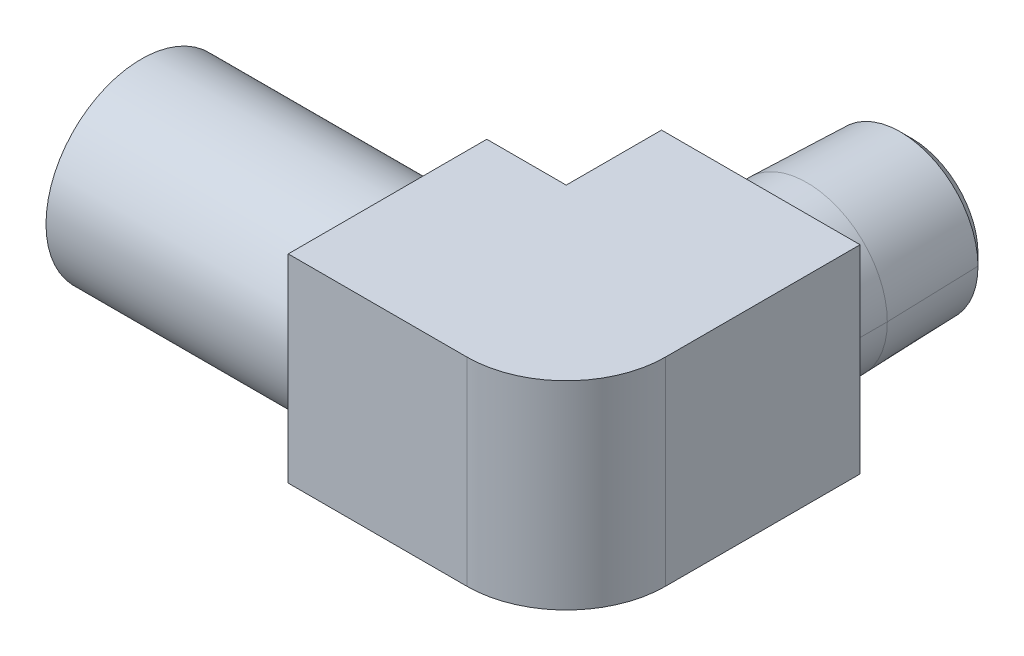
ISO-10303-21;
HEADER;
FILE_DESCRIPTION(('STEP AP214'),'2;1');
FILE_NAME('part.step','',(''),(''),'','','');
FILE_SCHEMA(('AUTOMOTIVE_DESIGN { 1 0 10303 214 1 1 1 1 }'));
ENDSEC;
DATA;
#1=APPLICATION_CONTEXT('core data for automotive mechanical design processes');
#2=APPLICATION_PROTOCOL_DEFINITION('international standard','automotive_design',2000,#1);
#3=PRODUCT_CONTEXT('',#1,'mechanical');
#4=PRODUCT('Part','Part','',(#3));
#5=PRODUCT_RELATED_PRODUCT_CATEGORY('part','',(#4));
#6=PRODUCT_DEFINITION_FORMATION('','',#4);
#7=PRODUCT_DEFINITION_CONTEXT('part definition',#1,'design');
#8=PRODUCT_DEFINITION('design','',#6,#7);
#9=PRODUCT_DEFINITION_SHAPE('','',#8);
#10=(LENGTH_UNIT() NAMED_UNIT(*) SI_UNIT(.MILLI.,.METRE.));
#11=(NAMED_UNIT(*) PLANE_ANGLE_UNIT() SI_UNIT($,.RADIAN.));
#12=(NAMED_UNIT(*) SI_UNIT($,.STERADIAN.) SOLID_ANGLE_UNIT());
#13=UNCERTAINTY_MEASURE_WITH_UNIT(LENGTH_MEASURE(1.E-05),#10,'distance_accuracy_value','');
#14=(GEOMETRIC_REPRESENTATION_CONTEXT(3) GLOBAL_UNCERTAINTY_ASSIGNED_CONTEXT((#13)) GLOBAL_UNIT_ASSIGNED_CONTEXT((#10,
#11,#12)) REPRESENTATION_CONTEXT('',''));
#15=CARTESIAN_POINT('',(0.,0.,0.));
#16=DIRECTION('',(0.,0.,1.));
#17=DIRECTION('',(1.,0.,0.));
#18=AXIS2_PLACEMENT_3D('',#15,#16,#17);
#19=CARTESIAN_POINT('',(27.178,0.,-18.74647));
#20=DIRECTION('',(0.,0.,1.));
#21=DIRECTION('',(-1.,0.,0.));
#22=AXIS2_PLACEMENT_3D('',#19,#20,#21);
#23=CONICAL_SURFACE('',#22,5.03914980109326,0.0311250383214112);
#24=DIRECTION('',(-0.0311200130745938,0.,0.999515655098127));
#25=VECTOR('',#24,1.);
#26=CARTESIAN_POINT('',(22.1388501989067,0.,-18.74647));
#27=LINE('',#26,#25);
#28=CARTESIAN_POINT('',(22.2208896002843,0.,-21.3814196002843));
#29=VERTEX_POINT('',#28);
#30=CARTESIAN_POINT('',(22.0345,0.,-15.39494));
#31=VERTEX_POINT('',#30);
#32=EDGE_CURVE('E49',#29,#31,#27,.T.);
#33=ORIENTED_EDGE('',*,*,#32,.F.);
#34=CARTESIAN_POINT('',(27.178,0.,-21.3814196002843));
#35=DIRECTION('',(0.,0.,1.));
#36=DIRECTION('',(-1.,0.,0.));
#37=AXIS2_PLACEMENT_3D('',#34,#35,#36);
#38=CIRCLE('',#37,4.9571103997157);
#39=CARTESIAN_POINT('',(32.1351103997157,0.,-21.3814196002843));
#40=VERTEX_POINT('',#39);
#41=EDGE_CURVE('E365',#29,#40,#38,.T.);
#42=ORIENTED_EDGE('',*,*,#41,.T.);
#43=DIRECTION('',(-0.0311200130745935,0.,-0.999515655098127));
#44=VECTOR('',#43,1.);
#45=CARTESIAN_POINT('',(32.2171498010933,0.,-18.74647));
#46=LINE('',#45,#44);
#47=CARTESIAN_POINT('',(32.3215,0.,-15.39494));
#48=VERTEX_POINT('',#47);
#49=EDGE_CURVE('E11',#48,#40,#46,.T.);
#50=ORIENTED_EDGE('',*,*,#49,.F.);
#51=CARTESIAN_POINT('',(27.178,0.,-15.39494));
#52=DIRECTION('',(0.,0.,1.));
#53=DIRECTION('',(-1.,0.,0.));
#54=AXIS2_PLACEMENT_3D('',#51,#52,#53);
#55=CIRCLE('',#54,5.1435);
#56=EDGE_CURVE('E339',#31,#48,#55,.T.);
#57=ORIENTED_EDGE('',*,*,#56,.F.);
#58=EDGE_LOOP('',(#33,#42,#50,#57));
#59=FACE_BOUND('',#58,.T.);
#60=ADVANCED_FACE('F46',(#59),#23,.T.);
#61=CARTESIAN_POINT('',(27.178,0.,-18.74647));
#62=DIRECTION('',(0.,0.,1.));
#63=DIRECTION('',(-1.,0.,0.));
#64=AXIS2_PLACEMENT_3D('',#61,#62,#63);
#65=CONICAL_SURFACE('',#64,5.03914980109326,0.0311250383214112);
#66=ORIENTED_EDGE('',*,*,#32,.T.);
#67=CARTESIAN_POINT('',(27.178,0.,-15.39494));
#68=DIRECTION('',(0.,0.,1.));
#69=DIRECTION('',(-1.,0.,0.));
#70=AXIS2_PLACEMENT_3D('',#67,#68,#69);
#71=CIRCLE('',#70,5.1435);
#72=EDGE_CURVE('E197',#48,#31,#71,.T.);
#73=ORIENTED_EDGE('',*,*,#72,.F.);
#74=ORIENTED_EDGE('',*,*,#49,.T.);
#75=CARTESIAN_POINT('',(27.178,0.,-21.3814196002843));
#76=DIRECTION('',(0.,0.,1.));
#77=DIRECTION('',(-1.,0.,0.));
#78=AXIS2_PLACEMENT_3D('',#75,#76,#77);
#79=CIRCLE('',#78,4.9571103997157);
#80=EDGE_CURVE('E364',#40,#29,#79,.T.);
#81=ORIENTED_EDGE('',*,*,#80,.T.);
#82=EDGE_LOOP('',(#66,#73,#74,#81));
#83=FACE_BOUND('',#82,.T.);
#84=ADVANCED_FACE('F576',(#83),#65,.T.);
#85=CARTESIAN_POINT('',(27.178,0.,-21.646515));
#86=DIRECTION('',(0.,0.,1.));
#87=DIRECTION('',(-1.,0.,0.));
#88=AXIS2_PLACEMENT_3D('',#85,#86,#87);
#89=CONICAL_SURFACE('',#88,4.692015,0.785398163397448);
#90=DIRECTION('',(0.707106781186548,0.,-0.707106781186547));
#91=VECTOR('',#90,1.);
#92=CARTESIAN_POINT('',(22.485985,0.,-21.646515));
#93=LINE('',#92,#91);
#94=CARTESIAN_POINT('',(22.93747,0.,-22.098));
#95=VERTEX_POINT('',#94);
#96=EDGE_CURVE('E361',#29,#95,#93,.T.);
#97=ORIENTED_EDGE('',*,*,#96,.T.);
#98=CARTESIAN_POINT('',(27.178,0.,-22.098));
#99=DIRECTION('',(0.,0.,-1.));
#100=DIRECTION('',(-1.,0.,0.));
#101=AXIS2_PLACEMENT_3D('',#98,#99,#100);
#102=CIRCLE('',#101,4.24053);
#103=CARTESIAN_POINT('',(31.41853,0.,-22.098));
#104=VERTEX_POINT('',#103);
#105=EDGE_CURVE('E241',#104,#95,#102,.T.);
#106=ORIENTED_EDGE('',*,*,#105,.F.);
#107=DIRECTION('',(0.707106781186548,0.,0.707106781186547));
#108=VECTOR('',#107,1.);
#109=CARTESIAN_POINT('',(31.870015,0.,-21.646515));
#110=LINE('',#109,#108);
#111=EDGE_CURVE('E202',#104,#40,#110,.T.);
#112=ORIENTED_EDGE('',*,*,#111,.T.);
#113=ORIENTED_EDGE('',*,*,#41,.F.);
#114=EDGE_LOOP('',(#97,#106,#112,#113));
#115=FACE_BOUND('',#114,.T.);
#116=ADVANCED_FACE('F441',(#115),#89,.T.);
#117=CARTESIAN_POINT('',(27.178,0.,-13.92047));
#118=DIRECTION('',(0.,0.,1.));
#119=DIRECTION('',(-1.,0.,0.));
#120=AXIS2_PLACEMENT_3D('',#117,#118,#119);
#121=CYLINDRICAL_SURFACE('',#120,5.1435);
#122=DIRECTION('',(0.,0.,1.));
#123=VECTOR('',#122,1.);
#124=CARTESIAN_POINT('',(22.0345,0.,-13.92047));
#125=LINE('',#124,#123);
#126=CARTESIAN_POINT('',(22.0345,0.,-12.446));
#127=VERTEX_POINT('',#126);
#128=EDGE_CURVE('E191',#31,#127,#125,.T.);
#129=ORIENTED_EDGE('',*,*,#128,.F.);
#130=ORIENTED_EDGE('',*,*,#56,.T.);
#131=DIRECTION('',(0.,0.,-1.));
#132=VECTOR('',#131,1.);
#133=CARTESIAN_POINT('',(32.3215,0.,-13.92047));
#134=LINE('',#133,#132);
#135=CARTESIAN_POINT('',(32.3215,0.,-12.446));
#136=VERTEX_POINT('',#135);
#137=EDGE_CURVE('E201',#136,#48,#134,.T.);
#138=ORIENTED_EDGE('',*,*,#137,.F.);
#139=CARTESIAN_POINT('',(27.178,0.,-12.446));
#140=DIRECTION('',(0.,0.,1.));
#141=DIRECTION('',(-1.,0.,0.));
#142=AXIS2_PLACEMENT_3D('',#139,#140,#141);
#143=CIRCLE('',#142,5.1435);
#144=EDGE_CURVE('E207',#127,#136,#143,.T.);
#145=ORIENTED_EDGE('',*,*,#144,.F.);
#146=EDGE_LOOP('',(#129,#130,#138,#145));
#147=FACE_BOUND('',#146,.T.);
#148=ADVANCED_FACE('F211',(#147),#121,.T.);
#149=CARTESIAN_POINT('',(27.178,0.,-13.92047));
#150=DIRECTION('',(0.,0.,1.));
#151=DIRECTION('',(-1.,0.,0.));
#152=AXIS2_PLACEMENT_3D('',#149,#150,#151);
#153=CYLINDRICAL_SURFACE('',#152,5.1435);
#154=ORIENTED_EDGE('',*,*,#128,.T.);
#155=CARTESIAN_POINT('',(27.178,0.,-12.446));
#156=DIRECTION('',(0.,0.,1.));
#157=DIRECTION('',(-1.,0.,0.));
#158=AXIS2_PLACEMENT_3D('',#155,#156,#157);
#159=CIRCLE('',#158,5.1435);
#160=EDGE_CURVE('E195',#136,#127,#159,.T.);
#161=ORIENTED_EDGE('',*,*,#160,.F.);
#162=ORIENTED_EDGE('',*,*,#137,.T.);
#163=ORIENTED_EDGE('',*,*,#72,.T.);
#164=EDGE_LOOP('',(#154,#161,#162,#163));
#165=FACE_BOUND('',#164,.T.);
#166=ADVANCED_FACE('F193',(#165),#153,.T.);
#167=CARTESIAN_POINT('',(27.178,0.,-21.646515));
#168=DIRECTION('',(0.,0.,1.));
#169=DIRECTION('',(-1.,0.,0.));
#170=AXIS2_PLACEMENT_3D('',#167,#168,#169);
#171=CONICAL_SURFACE('',#170,4.692015,0.785398163397448);
#172=ORIENTED_EDGE('',*,*,#96,.F.);
#173=ORIENTED_EDGE('',*,*,#80,.F.);
#174=ORIENTED_EDGE('',*,*,#111,.F.);
#175=CARTESIAN_POINT('',(27.178,0.,-22.098));
#176=DIRECTION('',(0.,0.,-1.));
#177=DIRECTION('',(-1.,0.,0.));
#178=AXIS2_PLACEMENT_3D('',#175,#176,#177);
#179=CIRCLE('',#178,4.24053);
#180=EDGE_CURVE('E209',#95,#104,#179,.T.);
#181=ORIENTED_EDGE('',*,*,#180,.F.);
#182=EDGE_LOOP('',(#172,#173,#174,#181));
#183=FACE_BOUND('',#182,.T.);
#184=ADVANCED_FACE('F554',(#183),#171,.T.);
#185=CARTESIAN_POINT('',(24.7106001989067,0.,-22.098));
#186=DIRECTION('',(0.,0.,-1.));
#187=DIRECTION('',(0.,-1.,0.));
#188=AXIS2_PLACEMENT_3D('',#185,#186,#187);
#189=PLANE('',#188);
#190=ORIENTED_EDGE('',*,*,#180,.T.);
#191=ORIENTED_EDGE('',*,*,#105,.T.);
#192=EDGE_LOOP('',(#190,#191));
#193=FACE_BOUND('',#192,.T.);
#194=CARTESIAN_POINT('',(27.178,0.,-22.098));
#195=DIRECTION('',(0.,0.,1.));
#196=DIRECTION('',(-1.,0.,0.));
#197=AXIS2_PLACEMENT_3D('',#194,#195,#196);
#198=CIRCLE('',#197,2.286);
#199=CARTESIAN_POINT('',(24.892,0.,-22.098));
#200=VERTEX_POINT('',#199);
#201=CARTESIAN_POINT('',(29.464,0.,-22.098));
#202=VERTEX_POINT('',#201);
#203=EDGE_CURVE('E213',#200,#202,#198,.T.);
#204=ORIENTED_EDGE('',*,*,#203,.T.);
#205=CARTESIAN_POINT('',(27.178,0.,-22.098));
#206=DIRECTION('',(0.,0.,1.));
#207=DIRECTION('',(-1.,0.,0.));
#208=AXIS2_PLACEMENT_3D('',#205,#206,#207);
#209=CIRCLE('',#208,2.286);
#210=EDGE_CURVE('E351',#202,#200,#209,.T.);
#211=ORIENTED_EDGE('',*,*,#210,.T.);
#212=EDGE_LOOP('',(#204,#211));
#213=FACE_BOUND('',#212,.T.);
#214=ADVANCED_FACE('F546',(#193,#213),#189,.T.);
#215=CARTESIAN_POINT('',(30.353,0.,-12.446));
#216=DIRECTION('',(0.,0.,-1.));
#217=DIRECTION('',(0.,-1.,0.));
#218=AXIS2_PLACEMENT_3D('',#215,#216,#217);
#219=PLANE('',#218);
#220=ORIENTED_EDGE('',*,*,#144,.T.);
#221=ORIENTED_EDGE('',*,*,#160,.T.);
#222=EDGE_LOOP('',(#220,#221));
#223=FACE_BOUND('',#222,.T.);
#224=DIRECTION('',(1.,0.,0.));
#225=VECTOR('',#224,1.);
#226=CARTESIAN_POINT('',(20.828,-6.35,-12.446));
#227=LINE('',#226,#225);
#228=CARTESIAN_POINT('',(20.828,-6.35,-12.446));
#229=VERTEX_POINT('',#228);
#230=CARTESIAN_POINT('',(33.528,-6.35,-12.446));
#231=VERTEX_POINT('',#230);
#232=EDGE_CURVE('E347',#229,#231,#227,.T.);
#233=ORIENTED_EDGE('',*,*,#232,.F.);
#234=DIRECTION('',(0.,-1.,0.));
#235=VECTOR('',#234,1.);
#236=CARTESIAN_POINT('',(20.828,6.35,-12.446));
#237=LINE('',#236,#235);
#238=CARTESIAN_POINT('',(20.828,6.35,-12.446));
#239=VERTEX_POINT('',#238);
#240=EDGE_CURVE('E336',#239,#229,#237,.T.);
#241=ORIENTED_EDGE('',*,*,#240,.F.);
#242=DIRECTION('',(-1.,0.,0.));
#243=VECTOR('',#242,1.);
#244=CARTESIAN_POINT('',(33.528,6.35,-12.446));
#245=LINE('',#244,#243);
#246=CARTESIAN_POINT('',(33.528,6.35,-12.446));
#247=VERTEX_POINT('',#246);
#248=EDGE_CURVE('E273',#247,#239,#245,.T.);
#249=ORIENTED_EDGE('',*,*,#248,.F.);
#250=DIRECTION('',(0.,1.,0.));
#251=VECTOR('',#250,1.);
#252=CARTESIAN_POINT('',(33.528,-6.35,-12.446));
#253=LINE('',#252,#251);
#254=EDGE_CURVE('E322',#231,#247,#253,.T.);
#255=ORIENTED_EDGE('',*,*,#254,.F.);
#256=EDGE_LOOP('',(#233,#241,#249,#255));
#257=FACE_BOUND('',#256,.T.);
#258=ADVANCED_FACE('F205',(#223,#257),#219,.T.);
#259=CARTESIAN_POINT('',(27.178,0.,-17.272));
#260=DIRECTION('',(0.,0.,-1.));
#261=DIRECTION('',(-1.,0.,0.));
#262=AXIS2_PLACEMENT_3D('',#259,#260,#261);
#263=CYLINDRICAL_SURFACE('',#262,2.286);
#264=DIRECTION('',(0.,0.,1.));
#265=VECTOR('',#264,1.);
#266=CARTESIAN_POINT('',(24.892,0.,-17.272));
#267=LINE('',#266,#265);
#268=CARTESIAN_POINT('',(24.892,0.,-2.286));
#269=VERTEX_POINT('',#268);
#270=EDGE_CURVE('E350',#200,#269,#267,.T.);
#271=ORIENTED_EDGE('',*,*,#270,.T.);
#272=CARTESIAN_POINT('',(27.178,0.,0.));
#273=DIRECTION('',(0.707106781186547,0.,-0.707106781186548));
#274=DIRECTION('',(0.707106781186548,0.,0.707106781186547));
#275=AXIS2_PLACEMENT_3D('',#272,#273,#274);
#276=ELLIPSE('',#275,3.23289220358489,2.286);
#277=CARTESIAN_POINT('',(27.178,-2.286,0.));
#278=VERTEX_POINT('',#277);
#279=EDGE_CURVE('E318',#278,#269,#276,.T.);
#280=ORIENTED_EDGE('',*,*,#279,.F.);
#281=CARTESIAN_POINT('',(27.178,0.,0.));
#282=DIRECTION('',(0.,0.,1.));
#283=DIRECTION('',(1.,0.,0.));
#284=AXIS2_PLACEMENT_3D('',#281,#282,#283);
#285=CIRCLE('',#284,2.286);
#286=CARTESIAN_POINT('',(29.464,0.,0.));
#287=VERTEX_POINT('',#286);
#288=EDGE_CURVE('E248',#278,#287,#285,.T.);
#289=ORIENTED_EDGE('',*,*,#288,.T.);
#290=DIRECTION('',(0.,0.,-1.));
#291=VECTOR('',#290,1.);
#292=CARTESIAN_POINT('',(29.464,0.,-17.272));
#293=LINE('',#292,#291);
#294=EDGE_CURVE('E218',#287,#202,#293,.T.);
#295=ORIENTED_EDGE('',*,*,#294,.T.);
#296=ORIENTED_EDGE('',*,*,#203,.F.);
#297=EDGE_LOOP('',(#271,#280,#289,#295,#296));
#298=FACE_BOUND('',#297,.T.);
#299=ADVANCED_FACE('F386',(#298),#263,.F.);
#300=CARTESIAN_POINT('',(27.178,0.,-17.272));
#301=DIRECTION('',(0.,0.,-1.));
#302=DIRECTION('',(-1.,0.,0.));
#303=AXIS2_PLACEMENT_3D('',#300,#301,#302);
#304=CYLINDRICAL_SURFACE('',#303,2.286);
#305=ORIENTED_EDGE('',*,*,#270,.F.);
#306=ORIENTED_EDGE('',*,*,#210,.F.);
#307=ORIENTED_EDGE('',*,*,#294,.F.);
#308=CARTESIAN_POINT('',(27.178,0.,0.));
#309=DIRECTION('',(0.,0.,1.));
#310=DIRECTION('',(1.,0.,0.));
#311=AXIS2_PLACEMENT_3D('',#308,#309,#310);
#312=CIRCLE('',#311,2.286);
#313=CARTESIAN_POINT('',(27.178,2.286,0.));
#314=VERTEX_POINT('',#313);
#315=EDGE_CURVE('E236',#287,#314,#312,.T.);
#316=ORIENTED_EDGE('',*,*,#315,.T.);
#317=CARTESIAN_POINT('',(27.178,0.,0.));
#318=DIRECTION('',(0.707106781186547,0.,-0.707106781186548));
#319=DIRECTION('',(0.707106781186548,0.,0.707106781186547));
#320=AXIS2_PLACEMENT_3D('',#317,#318,#319);
#321=ELLIPSE('',#320,3.23289220358489,2.286);
#322=EDGE_CURVE('E304',#269,#314,#321,.T.);
#323=ORIENTED_EDGE('',*,*,#322,.F.);
#324=EDGE_LOOP('',(#305,#306,#307,#316,#323));
#325=FACE_BOUND('',#324,.T.);
#326=ADVANCED_FACE('F380',(#325),#304,.F.);
#327=CARTESIAN_POINT('',(15.748,-6.35,-6.35));
#328=DIRECTION('',(0.,-1.,0.));
#329=DIRECTION('',(-1.,0.,0.));
#330=AXIS2_PLACEMENT_3D('',#327,#328,#329);
#331=PLANE('',#330);
#332=DIRECTION('',(1.,0.,0.));
#333=VECTOR('',#332,1.);
#334=CARTESIAN_POINT('',(15.748,-6.35,6.35));
#335=LINE('',#334,#333);
#336=CARTESIAN_POINT('',(15.748,-6.35,6.35));
#337=VERTEX_POINT('',#336);
#338=CARTESIAN_POINT('',(27.178,-6.35,6.35));
#339=VERTEX_POINT('',#338);
#340=EDGE_CURVE('E222',#337,#339,#335,.T.);
#341=ORIENTED_EDGE('',*,*,#340,.F.);
#342=DIRECTION('',(0.,0.,-1.));
#343=VECTOR('',#342,1.);
#344=CARTESIAN_POINT('',(15.748,-6.35,6.35));
#345=LINE('',#344,#343);
#346=CARTESIAN_POINT('',(15.748,-6.35,-6.35));
#347=VERTEX_POINT('',#346);
#348=EDGE_CURVE('E290',#337,#347,#345,.T.);
#349=ORIENTED_EDGE('',*,*,#348,.T.);
#350=DIRECTION('',(1.,0.,0.));
#351=VECTOR('',#350,1.);
#352=CARTESIAN_POINT('',(15.748,-6.35,-6.35));
#353=LINE('',#352,#351);
#354=CARTESIAN_POINT('',(20.828,-6.35,-6.35));
#355=VERTEX_POINT('',#354);
#356=EDGE_CURVE('E282',#347,#355,#353,.T.);
#357=ORIENTED_EDGE('',*,*,#356,.T.);
#358=DIRECTION('',(0.,0.,-1.));
#359=VECTOR('',#358,1.);
#360=CARTESIAN_POINT('',(20.828,-6.35,0.));
#361=LINE('',#360,#359);
#362=EDGE_CURVE('E343',#355,#229,#361,.T.);
#363=ORIENTED_EDGE('',*,*,#362,.T.);
#364=ORIENTED_EDGE('',*,*,#232,.T.);
#365=DIRECTION('',(0.,0.,-1.));
#366=VECTOR('',#365,1.);
#367=CARTESIAN_POINT('',(33.528,-6.35,0.));
#368=LINE('',#367,#366);
#369=CARTESIAN_POINT('',(33.528,-6.35,0.));
#370=VERTEX_POINT('',#369);
#371=EDGE_CURVE('E278',#370,#231,#368,.T.);
#372=ORIENTED_EDGE('',*,*,#371,.F.);
#373=CARTESIAN_POINT('',(27.178,-6.35,0.));
#374=DIRECTION('',(0.,-1.,0.));
#375=DIRECTION('',(1.,0.,0.));
#376=AXIS2_PLACEMENT_3D('',#373,#374,#375);
#377=CIRCLE('',#376,6.35);
#378=EDGE_CURVE('E260',#370,#339,#377,.T.);
#379=ORIENTED_EDGE('',*,*,#378,.T.);
#380=EDGE_LOOP('',(#341,#349,#357,#363,#364,#372,#379));
#381=FACE_BOUND('',#380,.T.);
#382=ADVANCED_FACE('F385',(#381),#331,.T.);
#383=CARTESIAN_POINT('',(20.828,6.35,0.));
#384=DIRECTION('',(-1.,0.,0.));
#385=DIRECTION('',(0.,0.,1.));
#386=AXIS2_PLACEMENT_3D('',#383,#384,#385);
#387=PLANE('',#386);
#388=DIRECTION('',(0.,-1.,0.));
#389=VECTOR('',#388,1.);
#390=CARTESIAN_POINT('',(20.828,6.35,-6.35));
#391=LINE('',#390,#389);
#392=CARTESIAN_POINT('',(20.828,6.35,-6.35));
#393=VERTEX_POINT('',#392);
#394=EDGE_CURVE('E272',#393,#355,#391,.T.);
#395=ORIENTED_EDGE('',*,*,#394,.F.);
#396=DIRECTION('',(0.,0.,-1.));
#397=VECTOR('',#396,1.);
#398=CARTESIAN_POINT('',(20.828,6.35,0.));
#399=LINE('',#398,#397);
#400=EDGE_CURVE('E277',#393,#239,#399,.T.);
#401=ORIENTED_EDGE('',*,*,#400,.T.);
#402=ORIENTED_EDGE('',*,*,#240,.T.);
#403=ORIENTED_EDGE('',*,*,#362,.F.);
#404=EDGE_LOOP('',(#395,#401,#402,#403));
#405=FACE_BOUND('',#404,.T.);
#406=ADVANCED_FACE('F513',(#405),#387,.T.);
#407=CARTESIAN_POINT('',(15.748,6.35,6.35));
#408=DIRECTION('',(0.,1.,0.));
#409=DIRECTION('',(1.,0.,0.));
#410=AXIS2_PLACEMENT_3D('',#407,#408,#409);
#411=PLANE('',#410);
#412=DIRECTION('',(0.,0.,-1.));
#413=VECTOR('',#412,1.);
#414=CARTESIAN_POINT('',(33.528,6.35,0.));
#415=LINE('',#414,#413);
#416=CARTESIAN_POINT('',(33.528,6.35,0.));
#417=VERTEX_POINT('',#416);
#418=EDGE_CURVE('E326',#417,#247,#415,.T.);
#419=ORIENTED_EDGE('',*,*,#418,.T.);
#420=ORIENTED_EDGE('',*,*,#248,.T.);
#421=ORIENTED_EDGE('',*,*,#400,.F.);
#422=DIRECTION('',(1.,0.,0.));
#423=VECTOR('',#422,1.);
#424=CARTESIAN_POINT('',(15.748,6.35,-6.35));
#425=LINE('',#424,#423);
#426=CARTESIAN_POINT('',(15.748,6.35,-6.35));
#427=VERTEX_POINT('',#426);
#428=EDGE_CURVE('E288',#427,#393,#425,.T.);
#429=ORIENTED_EDGE('',*,*,#428,.F.);
#430=DIRECTION('',(0.,0.,1.));
#431=VECTOR('',#430,1.);
#432=CARTESIAN_POINT('',(15.748,6.35,-6.35));
#433=LINE('',#432,#431);
#434=CARTESIAN_POINT('',(15.748,6.35,6.35));
#435=VERTEX_POINT('',#434);
#436=EDGE_CURVE('E225',#427,#435,#433,.T.);
#437=ORIENTED_EDGE('',*,*,#436,.T.);
#438=DIRECTION('',(1.,0.,0.));
#439=VECTOR('',#438,1.);
#440=CARTESIAN_POINT('',(15.748,6.35,6.35));
#441=LINE('',#440,#439);
#442=CARTESIAN_POINT('',(27.178,6.35,6.35));
#443=VERTEX_POINT('',#442);
#444=EDGE_CURVE('E224',#435,#443,#441,.T.);
#445=ORIENTED_EDGE('',*,*,#444,.T.);
#446=CARTESIAN_POINT('',(27.178,6.35,0.));
#447=DIRECTION('',(0.,-1.,0.));
#448=DIRECTION('',(1.,0.,0.));
#449=AXIS2_PLACEMENT_3D('',#446,#447,#448);
#450=CIRCLE('',#449,6.35);
#451=EDGE_CURVE('E268',#417,#443,#450,.T.);
#452=ORIENTED_EDGE('',*,*,#451,.F.);
#453=EDGE_LOOP('',(#419,#420,#421,#429,#437,#445,#452));
#454=FACE_BOUND('',#453,.T.);
#455=ADVANCED_FACE('F503',(#454),#411,.T.);
#456=CARTESIAN_POINT('',(33.528,-6.35,0.));
#457=DIRECTION('',(1.,0.,0.));
#458=DIRECTION('',(0.,1.,0.));
#459=AXIS2_PLACEMENT_3D('',#456,#457,#458);
#460=PLANE('',#459);
#461=ORIENTED_EDGE('',*,*,#254,.T.);
#462=ORIENTED_EDGE('',*,*,#418,.F.);
#463=DIRECTION('',(0.,1.,0.));
#464=VECTOR('',#463,1.);
#465=CARTESIAN_POINT('',(33.528,-6.35,0.));
#466=LINE('',#465,#464);
#467=EDGE_CURVE('E264',#370,#417,#466,.T.);
#468=ORIENTED_EDGE('',*,*,#467,.F.);
#469=ORIENTED_EDGE('',*,*,#371,.T.);
#470=EDGE_LOOP('',(#461,#462,#468,#469));
#471=FACE_BOUND('',#470,.T.);
#472=ADVANCED_FACE('F494',(#471),#460,.T.);
#473=CARTESIAN_POINT('',(21.463,0.,0.));
#474=DIRECTION('',(1.,0.,0.));
#475=DIRECTION('',(0.,0.,-1.));
#476=AXIS2_PLACEMENT_3D('',#473,#474,#475);
#477=CYLINDRICAL_SURFACE('',#476,2.286);
#478=DIRECTION('',(-1.,0.,0.));
#479=VECTOR('',#478,1.);
#480=CARTESIAN_POINT('',(21.463,0.,-2.286));
#481=LINE('',#480,#479);
#482=CARTESIAN_POINT('',(0.,0.,-2.286));
#483=VERTEX_POINT('',#482);
#484=EDGE_CURVE('E301',#269,#483,#481,.T.);
#485=ORIENTED_EDGE('',*,*,#484,.T.);
#486=CARTESIAN_POINT('',(0.,0.,0.));
#487=DIRECTION('',(1.,0.,0.));
#488=DIRECTION('',(0.,0.,1.));
#489=AXIS2_PLACEMENT_3D('',#486,#487,#488);
#490=CIRCLE('',#489,2.286);
#491=CARTESIAN_POINT('',(0.,0.,2.286));
#492=VERTEX_POINT('',#491);
#493=EDGE_CURVE('E230',#492,#483,#490,.T.);
#494=ORIENTED_EDGE('',*,*,#493,.F.);
#495=DIRECTION('',(1.,0.,0.));
#496=VECTOR('',#495,1.);
#497=CARTESIAN_POINT('',(21.463,0.,2.286));
#498=LINE('',#497,#496);
#499=CARTESIAN_POINT('',(27.178,0.,2.286));
#500=VERTEX_POINT('',#499);
#501=EDGE_CURVE('E237',#492,#500,#498,.T.);
#502=ORIENTED_EDGE('',*,*,#501,.T.);
#503=CARTESIAN_POINT('',(27.178,0.,0.));
#504=DIRECTION('',(1.,0.,0.));
#505=DIRECTION('',(0.,0.,-1.));
#506=AXIS2_PLACEMENT_3D('',#503,#504,#505);
#507=CIRCLE('',#506,2.286);
#508=EDGE_CURVE('E314',#500,#278,#507,.T.);
#509=ORIENTED_EDGE('',*,*,#508,.T.);
#510=ORIENTED_EDGE('',*,*,#279,.T.);
#511=EDGE_LOOP('',(#485,#494,#502,#509,#510));
#512=FACE_BOUND('',#511,.T.);
#513=ADVANCED_FACE('F485',(#512),#477,.F.);
#514=CARTESIAN_POINT('',(27.178,0.,0.));
#515=DIRECTION('',(0.,0.,1.));
#516=DIRECTION('',(1.,0.,0.));
#517=AXIS2_PLACEMENT_3D('',#514,#515,#516);
#518=SPHERICAL_SURFACE('',#517,2.286);
#519=CARTESIAN_POINT('',(27.178,0.,0.));
#520=DIRECTION('',(0.,1.,0.));
#521=DIRECTION('',(0.,0.,1.));
#522=AXIS2_PLACEMENT_3D('',#519,#520,#521);
#523=CIRCLE('',#522,2.286);
#524=EDGE_CURVE('E232',#500,#287,#523,.T.);
#525=ORIENTED_EDGE('',*,*,#524,.T.);
#526=ORIENTED_EDGE('',*,*,#288,.F.);
#527=ORIENTED_EDGE('',*,*,#508,.F.);
#528=EDGE_LOOP('',(#525,#526,#527));
#529=FACE_BOUND('',#528,.T.);
#530=ADVANCED_FACE('F476',(#529),#518,.F.);
#531=CARTESIAN_POINT('',(27.178,0.,0.));
#532=DIRECTION('',(0.,0.,1.));
#533=DIRECTION('',(1.,0.,0.));
#534=AXIS2_PLACEMENT_3D('',#531,#532,#533);
#535=SPHERICAL_SURFACE('',#534,2.286);
#536=ORIENTED_EDGE('',*,*,#524,.F.);
#537=CARTESIAN_POINT('',(27.178,0.,0.));
#538=DIRECTION('',(1.,0.,0.));
#539=DIRECTION('',(0.,0.,-1.));
#540=AXIS2_PLACEMENT_3D('',#537,#538,#539);
#541=CIRCLE('',#540,2.286);
#542=EDGE_CURVE('E252',#314,#500,#541,.T.);
#543=ORIENTED_EDGE('',*,*,#542,.F.);
#544=ORIENTED_EDGE('',*,*,#315,.F.);
#545=EDGE_LOOP('',(#536,#543,#544));
#546=FACE_BOUND('',#545,.T.);
#547=ADVANCED_FACE('F468',(#546),#535,.F.);
#548=CARTESIAN_POINT('',(21.463,0.,0.));
#549=DIRECTION('',(1.,0.,0.));
#550=DIRECTION('',(0.,0.,-1.));
#551=AXIS2_PLACEMENT_3D('',#548,#549,#550);
#552=CYLINDRICAL_SURFACE('',#551,2.286);
#553=ORIENTED_EDGE('',*,*,#484,.F.);
#554=ORIENTED_EDGE('',*,*,#322,.T.);
#555=ORIENTED_EDGE('',*,*,#542,.T.);
#556=ORIENTED_EDGE('',*,*,#501,.F.);
#557=CARTESIAN_POINT('',(0.,0.,0.));
#558=DIRECTION('',(1.,0.,0.));
#559=DIRECTION('',(0.,0.,1.));
#560=AXIS2_PLACEMENT_3D('',#557,#558,#559);
#561=CIRCLE('',#560,2.286);
#562=EDGE_CURVE('E245',#483,#492,#561,.T.);
#563=ORIENTED_EDGE('',*,*,#562,.F.);
#564=EDGE_LOOP('',(#553,#554,#555,#556,#563));
#565=FACE_BOUND('',#564,.T.);
#566=ADVANCED_FACE('F399',(#565),#552,.F.);
#567=CARTESIAN_POINT('',(15.748,-6.35,6.35));
#568=DIRECTION('',(0.,0.,1.));
#569=DIRECTION('',(1.,0.,0.));
#570=AXIS2_PLACEMENT_3D('',#567,#568,#569);
#571=PLANE('',#570);
#572=DIRECTION('',(0.,-1.,0.));
#573=VECTOR('',#572,1.);
#574=CARTESIAN_POINT('',(15.748,6.35,6.35));
#575=LINE('',#574,#573);
#576=EDGE_CURVE('E293',#435,#337,#575,.T.);
#577=ORIENTED_EDGE('',*,*,#576,.T.);
#578=ORIENTED_EDGE('',*,*,#340,.T.);
#579=DIRECTION('',(0.,1.,0.));
#580=VECTOR('',#579,1.);
#581=CARTESIAN_POINT('',(27.178,6.35,6.35));
#582=LINE('',#581,#580);
#583=EDGE_CURVE('E256',#339,#443,#582,.T.);
#584=ORIENTED_EDGE('',*,*,#583,.T.);
#585=ORIENTED_EDGE('',*,*,#444,.F.);
#586=EDGE_LOOP('',(#577,#578,#584,#585));
#587=FACE_BOUND('',#586,.T.);
#588=ADVANCED_FACE('F393',(#587),#571,.T.);
#589=CARTESIAN_POINT('',(15.748,0.,-3.175));
#590=DIRECTION('',(-1.,0.,0.));
#591=DIRECTION('',(0.,0.,1.));
#592=AXIS2_PLACEMENT_3D('',#589,#590,#591);
#593=PLANE('',#592);
#594=ORIENTED_EDGE('',*,*,#348,.F.);
#595=ORIENTED_EDGE('',*,*,#576,.F.);
#596=ORIENTED_EDGE('',*,*,#436,.F.);
#597=DIRECTION('',(0.,1.,0.));
#598=VECTOR('',#597,1.);
#599=CARTESIAN_POINT('',(15.748,-6.35,-6.35));
#600=LINE('',#599,#598);
#601=EDGE_CURVE('E286',#347,#427,#600,.T.);
#602=ORIENTED_EDGE('',*,*,#601,.F.);
#603=EDGE_LOOP('',(#594,#595,#596,#602));
#604=FACE_BOUND('',#603,.T.);
#605=CARTESIAN_POINT('',(15.748,0.,0.));
#606=DIRECTION('',(1.,0.,0.));
#607=DIRECTION('',(0.,0.,1.));
#608=AXIS2_PLACEMENT_3D('',#605,#606,#607);
#609=CIRCLE('',#608,6.096);
#610=CARTESIAN_POINT('',(15.748,0.,6.096));
#611=VERTEX_POINT('',#610);
#612=EDGE_CURVE('E226',#611,#611,#609,.T.);
#613=ORIENTED_EDGE('',*,*,#612,.T.);
#614=EDGE_LOOP('',(#613));
#615=FACE_BOUND('',#614,.T.);
#616=ADVANCED_FACE('F398',(#604,#615),#593,.T.);
#617=CARTESIAN_POINT('',(15.748,6.35,-6.35));
#618=DIRECTION('',(0.,0.,-1.));
#619=DIRECTION('',(0.,-1.,0.));
#620=AXIS2_PLACEMENT_3D('',#617,#618,#619);
#621=PLANE('',#620);
#622=ORIENTED_EDGE('',*,*,#394,.T.);
#623=ORIENTED_EDGE('',*,*,#356,.F.);
#624=ORIENTED_EDGE('',*,*,#601,.T.);
#625=ORIENTED_EDGE('',*,*,#428,.T.);
#626=EDGE_LOOP('',(#622,#623,#624,#625));
#627=FACE_BOUND('',#626,.T.);
#628=ADVANCED_FACE('F432',(#627),#621,.T.);
#629=CARTESIAN_POINT('',(27.178,0.,0.));
#630=DIRECTION('',(0.,-1.,0.));
#631=DIRECTION('',(1.,0.,0.));
#632=AXIS2_PLACEMENT_3D('',#629,#630,#631);
#633=CYLINDRICAL_SURFACE('',#632,6.35);
#634=ORIENTED_EDGE('',*,*,#583,.F.);
#635=ORIENTED_EDGE('',*,*,#378,.F.);
#636=ORIENTED_EDGE('',*,*,#467,.T.);
#637=ORIENTED_EDGE('',*,*,#451,.T.);
#638=EDGE_LOOP('',(#634,#635,#636,#637));
#639=FACE_BOUND('',#638,.T.);
#640=ADVANCED_FACE('F420',(#639),#633,.T.);
#641=CARTESIAN_POINT('',(0.,0.,3.048));
#642=DIRECTION('',(-1.,0.,0.));
#643=DIRECTION('',(0.,1.,0.));
#644=AXIS2_PLACEMENT_3D('',#641,#642,#643);
#645=PLANE('',#644);
#646=CARTESIAN_POINT('',(0.,0.,0.));
#647=DIRECTION('',(-1.,0.,0.));
#648=DIRECTION('',(0.,0.,1.));
#649=AXIS2_PLACEMENT_3D('',#646,#647,#648);
#650=CIRCLE('',#649,6.096);
#651=CARTESIAN_POINT('',(0.,0.,6.096));
#652=VERTEX_POINT('',#651);
#653=EDGE_CURVE('E231',#652,#652,#650,.T.);
#654=ORIENTED_EDGE('',*,*,#653,.T.);
#655=EDGE_LOOP('',(#654));
#656=FACE_BOUND('',#655,.T.);
#657=ORIENTED_EDGE('',*,*,#493,.T.);
#658=ORIENTED_EDGE('',*,*,#562,.T.);
#659=EDGE_LOOP('',(#657,#658));
#660=FACE_BOUND('',#659,.T.);
#661=ADVANCED_FACE('F410',(#656,#660),#645,.T.);
#662=CARTESIAN_POINT('',(2.413,0.,0.));
#663=DIRECTION('',(-1.,0.,0.));
#664=DIRECTION('',(0.,0.,1.));
#665=AXIS2_PLACEMENT_3D('',#662,#663,#664);
#666=CYLINDRICAL_SURFACE('',#665,6.096);
#667=ORIENTED_EDGE('',*,*,#612,.F.);
#668=EDGE_LOOP('',(#667));
#669=FACE_BOUND('',#668,.T.);
#670=ORIENTED_EDGE('',*,*,#653,.F.);
#671=EDGE_LOOP('',(#670));
#672=FACE_BOUND('',#671,.T.);
#673=ADVANCED_FACE('F406',(#669,#672),#666,.T.);
#674=CLOSED_SHELL('',(#60,#84,#116,#148,#166,#184,#214,#258,#299,#326,#382,#406,#455,#472,#513,
#530,#547,#566,#588,#616,#628,#640,#661,#673));
#675=MANIFOLD_SOLID_BREP('B2',#674);
#676=ADVANCED_BREP_SHAPE_REPRESENTATION('',(#18,#675),#14);
#677=SHAPE_DEFINITION_REPRESENTATION(#9,#676);
ENDSEC;
END-ISO-10303-21;
